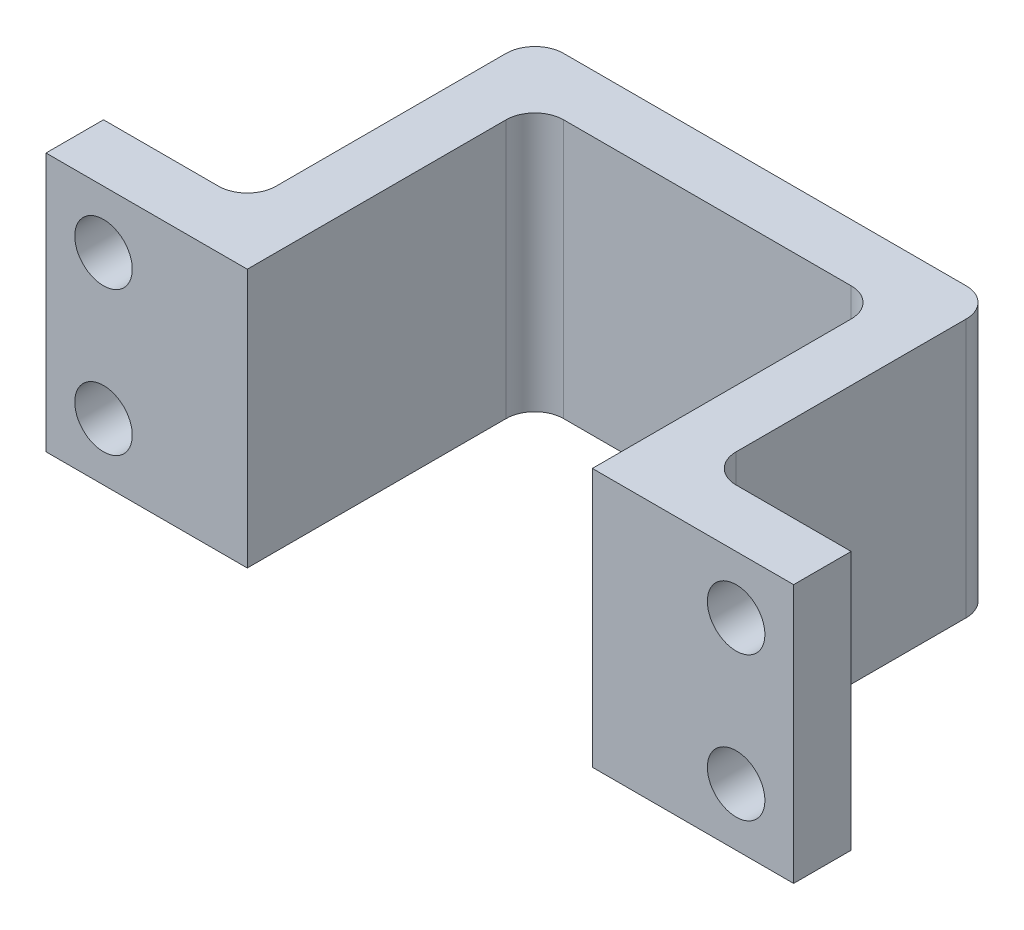
ISO-10303-21;
HEADER;
FILE_DESCRIPTION(('STEP AP214'),'2;1');
FILE_NAME('part.step','',(''),(''),'','','');
FILE_SCHEMA(('AUTOMOTIVE_DESIGN { 1 0 10303 214 1 1 1 1 }'));
ENDSEC;
DATA;
#1=APPLICATION_CONTEXT('core data for automotive mechanical design processes');
#2=APPLICATION_PROTOCOL_DEFINITION('international standard','automotive_design',2000,#1);
#3=PRODUCT_CONTEXT('',#1,'mechanical');
#4=PRODUCT('Part','Part','',(#3));
#5=PRODUCT_RELATED_PRODUCT_CATEGORY('part','',(#4));
#6=PRODUCT_DEFINITION_FORMATION('','',#4);
#7=PRODUCT_DEFINITION_CONTEXT('part definition',#1,'design');
#8=PRODUCT_DEFINITION('design','',#6,#7);
#9=PRODUCT_DEFINITION_SHAPE('','',#8);
#10=(LENGTH_UNIT() NAMED_UNIT(*) SI_UNIT(.MILLI.,.METRE.));
#11=(NAMED_UNIT(*) PLANE_ANGLE_UNIT() SI_UNIT($,.RADIAN.));
#12=(NAMED_UNIT(*) SI_UNIT($,.STERADIAN.) SOLID_ANGLE_UNIT());
#13=UNCERTAINTY_MEASURE_WITH_UNIT(LENGTH_MEASURE(1.E-05),#10,'distance_accuracy_value','');
#14=(GEOMETRIC_REPRESENTATION_CONTEXT(3) GLOBAL_UNCERTAINTY_ASSIGNED_CONTEXT((#13)) GLOBAL_UNIT_ASSIGNED_CONTEXT((#10,
#11,#12)) REPRESENTATION_CONTEXT('',''));
#15=CARTESIAN_POINT('',(0.,0.,0.));
#16=DIRECTION('',(0.,0.,1.));
#17=DIRECTION('',(1.,0.,0.));
#18=AXIS2_PLACEMENT_3D('',#15,#16,#17);
#19=CARTESIAN_POINT('',(0.,9.,0.));
#20=DIRECTION('',(-1.,0.,0.));
#21=DIRECTION('',(0.,0.,1.));
#22=AXIS2_PLACEMENT_3D('',#19,#20,#21);
#23=PLANE('',#22);
#24=DIRECTION('',(0.,0.,-1.));
#25=VECTOR('',#24,1.);
#26=CARTESIAN_POINT('',(0.,0.,0.));
#27=LINE('',#26,#25);
#28=CARTESIAN_POINT('',(0.,0.,0.));
#29=VERTEX_POINT('',#28);
#30=CARTESIAN_POINT('',(0.,0.,-8.99999999999999));
#31=VERTEX_POINT('',#30);
#32=EDGE_CURVE('E205',#29,#31,#27,.T.);
#33=ORIENTED_EDGE('',*,*,#32,.T.);
#34=DIRECTION('',(0.,-1.,0.));
#35=VECTOR('',#34,1.);
#36=CARTESIAN_POINT('',(0.,9.,-8.99999999999999));
#37=LINE('',#36,#35);
#38=CARTESIAN_POINT('',(0.,9.,-8.99999999999999));
#39=VERTEX_POINT('',#38);
#40=EDGE_CURVE('E48',#39,#31,#37,.T.);
#41=ORIENTED_EDGE('',*,*,#40,.F.);
#42=DIRECTION('',(0.,0.,-1.));
#43=VECTOR('',#42,1.);
#44=CARTESIAN_POINT('',(0.,9.,0.));
#45=LINE('',#44,#43);
#46=CARTESIAN_POINT('',(0.,9.,0.));
#47=VERTEX_POINT('',#46);
#48=EDGE_CURVE('E131',#47,#39,#45,.T.);
#49=ORIENTED_EDGE('',*,*,#48,.F.);
#50=DIRECTION('',(0.,-1.,0.));
#51=VECTOR('',#50,1.);
#52=CARTESIAN_POINT('',(0.,9.,0.));
#53=LINE('',#52,#51);
#54=EDGE_CURVE('E11',#47,#29,#53,.T.);
#55=ORIENTED_EDGE('',*,*,#54,.T.);
#56=EDGE_LOOP('',(#33,#41,#49,#55));
#57=FACE_BOUND('',#56,.T.);
#58=ADVANCED_FACE('F38',(#57),#23,.F.);
#59=CARTESIAN_POINT('',(1.,9.,-9.));
#60=DIRECTION('',(0.,-1.,0.));
#61=DIRECTION('',(0.,0.,-1.));
#62=AXIS2_PLACEMENT_3D('',#59,#60,#61);
#63=CYLINDRICAL_SURFACE('',#62,1.);
#64=CARTESIAN_POINT('',(1.,0.,-9.));
#65=DIRECTION('',(0.,-1.,0.));
#66=DIRECTION('',(0.,0.,-1.));
#67=AXIS2_PLACEMENT_3D('',#64,#65,#66);
#68=CIRCLE('',#67,1.);
#69=CARTESIAN_POINT('',(1.,0.,-10.));
#70=VERTEX_POINT('',#69);
#71=EDGE_CURVE('E208',#31,#70,#68,.T.);
#72=ORIENTED_EDGE('',*,*,#71,.T.);
#73=DIRECTION('',(0.,-1.,0.));
#74=VECTOR('',#73,1.);
#75=CARTESIAN_POINT('',(1.,9.,-10.));
#76=LINE('',#75,#74);
#77=CARTESIAN_POINT('',(1.,9.,-10.));
#78=VERTEX_POINT('',#77);
#79=EDGE_CURVE('E308',#78,#70,#76,.T.);
#80=ORIENTED_EDGE('',*,*,#79,.F.);
#81=CARTESIAN_POINT('',(1.,9.,-9.));
#82=DIRECTION('',(0.,-1.,0.));
#83=DIRECTION('',(0.,0.,-1.));
#84=AXIS2_PLACEMENT_3D('',#81,#82,#83);
#85=CIRCLE('',#84,1.);
#86=EDGE_CURVE('E345',#39,#78,#85,.T.);
#87=ORIENTED_EDGE('',*,*,#86,.F.);
#88=ORIENTED_EDGE('',*,*,#40,.T.);
#89=EDGE_LOOP('',(#72,#80,#87,#88));
#90=FACE_BOUND('',#89,.T.);
#91=ADVANCED_FACE('F401',(#90),#63,.F.);
#92=CARTESIAN_POINT('',(1.00000000000001,9.,-10.));
#93=DIRECTION('',(0.,0.,-1.));
#94=DIRECTION('',(-1.,0.,0.));
#95=AXIS2_PLACEMENT_3D('',#92,#93,#94);
#96=PLANE('',#95);
#97=DIRECTION('',(1.,0.,0.));
#98=VECTOR('',#97,1.);
#99=CARTESIAN_POINT('',(1.00000000000001,0.,-10.));
#100=LINE('',#99,#98);
#101=CARTESIAN_POINT('',(11.,0.,-10.));
#102=VERTEX_POINT('',#101);
#103=EDGE_CURVE('E212',#70,#102,#100,.T.);
#104=ORIENTED_EDGE('',*,*,#103,.T.);
#105=DIRECTION('',(0.,-1.,0.));
#106=VECTOR('',#105,1.);
#107=CARTESIAN_POINT('',(11.,9.,-10.));
#108=LINE('',#107,#106);
#109=CARTESIAN_POINT('',(11.,9.,-10.));
#110=VERTEX_POINT('',#109);
#111=EDGE_CURVE('E304',#110,#102,#108,.T.);
#112=ORIENTED_EDGE('',*,*,#111,.F.);
#113=DIRECTION('',(1.,0.,0.));
#114=VECTOR('',#113,1.);
#115=CARTESIAN_POINT('',(1.00000000000001,9.,-10.));
#116=LINE('',#115,#114);
#117=EDGE_CURVE('E348',#78,#110,#116,.T.);
#118=ORIENTED_EDGE('',*,*,#117,.F.);
#119=ORIENTED_EDGE('',*,*,#79,.T.);
#120=EDGE_LOOP('',(#104,#112,#118,#119));
#121=FACE_BOUND('',#120,.T.);
#122=ADVANCED_FACE('F406',(#121),#96,.F.);
#123=CARTESIAN_POINT('',(11.,9.,-9.));
#124=DIRECTION('',(0.,-1.,0.));
#125=DIRECTION('',(0.,0.,-1.));
#126=AXIS2_PLACEMENT_3D('',#123,#124,#125);
#127=CYLINDRICAL_SURFACE('',#126,0.999999999999999);
#128=CARTESIAN_POINT('',(11.,0.,-9.));
#129=DIRECTION('',(0.,-1.,0.));
#130=DIRECTION('',(0.,0.,-1.));
#131=AXIS2_PLACEMENT_3D('',#128,#129,#130);
#132=CIRCLE('',#131,0.999999999999999);
#133=CARTESIAN_POINT('',(12.,0.,-8.99999999999999));
#134=VERTEX_POINT('',#133);
#135=EDGE_CURVE('E215',#102,#134,#132,.T.);
#136=ORIENTED_EDGE('',*,*,#135,.T.);
#137=DIRECTION('',(0.,-1.,0.));
#138=VECTOR('',#137,1.);
#139=CARTESIAN_POINT('',(12.,9.,-8.99999999999999));
#140=LINE('',#139,#138);
#141=CARTESIAN_POINT('',(12.,9.,-8.99999999999999));
#142=VERTEX_POINT('',#141);
#143=EDGE_CURVE('E300',#142,#134,#140,.T.);
#144=ORIENTED_EDGE('',*,*,#143,.F.);
#145=CARTESIAN_POINT('',(11.,9.,-9.));
#146=DIRECTION('',(0.,-1.,0.));
#147=DIRECTION('',(0.,0.,-1.));
#148=AXIS2_PLACEMENT_3D('',#145,#146,#147);
#149=CIRCLE('',#148,0.999999999999999);
#150=EDGE_CURVE('E351',#110,#142,#149,.T.);
#151=ORIENTED_EDGE('',*,*,#150,.F.);
#152=ORIENTED_EDGE('',*,*,#111,.T.);
#153=EDGE_LOOP('',(#136,#144,#151,#152));
#154=FACE_BOUND('',#153,.T.);
#155=ADVANCED_FACE('F412',(#154),#127,.F.);
#156=CARTESIAN_POINT('',(12.,9.,0.));
#157=DIRECTION('',(1.,0.,0.));
#158=DIRECTION('',(0.,0.,-1.));
#159=AXIS2_PLACEMENT_3D('',#156,#157,#158);
#160=PLANE('',#159);
#161=DIRECTION('',(0.,0.,1.));
#162=VECTOR('',#161,1.);
#163=CARTESIAN_POINT('',(12.,0.,0.));
#164=LINE('',#163,#162);
#165=CARTESIAN_POINT('',(12.,0.,0.));
#166=VERTEX_POINT('',#165);
#167=EDGE_CURVE('E218',#134,#166,#164,.T.);
#168=ORIENTED_EDGE('',*,*,#167,.T.);
#169=DIRECTION('',(0.,-1.,0.));
#170=VECTOR('',#169,1.);
#171=CARTESIAN_POINT('',(12.,9.,0.));
#172=LINE('',#171,#170);
#173=CARTESIAN_POINT('',(12.,9.,0.));
#174=VERTEX_POINT('',#173);
#175=EDGE_CURVE('E296',#174,#166,#172,.T.);
#176=ORIENTED_EDGE('',*,*,#175,.F.);
#177=DIRECTION('',(0.,0.,1.));
#178=VECTOR('',#177,1.);
#179=CARTESIAN_POINT('',(12.,9.,0.));
#180=LINE('',#179,#178);
#181=EDGE_CURVE('E354',#142,#174,#180,.T.);
#182=ORIENTED_EDGE('',*,*,#181,.F.);
#183=ORIENTED_EDGE('',*,*,#143,.T.);
#184=EDGE_LOOP('',(#168,#176,#182,#183));
#185=FACE_BOUND('',#184,.T.);
#186=ADVANCED_FACE('F416',(#185),#160,.F.);
#187=CARTESIAN_POINT('',(13.3183856502242,9.,0.));
#188=DIRECTION('',(0.,0.,-1.));
#189=DIRECTION('',(-1.,0.,0.));
#190=AXIS2_PLACEMENT_3D('',#187,#188,#189);
#191=PLANE('',#190);
#192=CARTESIAN_POINT('',(17.,2.,0.));
#193=DIRECTION('',(0.,0.,-1.));
#194=DIRECTION('',(-1.,0.,0.));
#195=AXIS2_PLACEMENT_3D('',#192,#193,#194);
#196=CIRCLE('',#195,1.);
#197=CARTESIAN_POINT('',(16.,2.,0.));
#198=VERTEX_POINT('',#197);
#199=EDGE_CURVE('E209',#198,#198,#196,.T.);
#200=ORIENTED_EDGE('',*,*,#199,.T.);
#201=EDGE_LOOP('',(#200));
#202=FACE_BOUND('',#201,.T.);
#203=CARTESIAN_POINT('',(17.,7.,0.));
#204=DIRECTION('',(0.,0.,-1.));
#205=DIRECTION('',(-1.,0.,0.));
#206=AXIS2_PLACEMENT_3D('',#203,#204,#205);
#207=CIRCLE('',#206,1.);
#208=CARTESIAN_POINT('',(16.,7.,0.));
#209=VERTEX_POINT('',#208);
#210=EDGE_CURVE('E323',#209,#209,#207,.T.);
#211=ORIENTED_EDGE('',*,*,#210,.T.);
#212=EDGE_LOOP('',(#211));
#213=FACE_BOUND('',#212,.T.);
#214=DIRECTION('',(1.,0.,0.));
#215=VECTOR('',#214,1.);
#216=CARTESIAN_POINT('',(13.3183856502242,0.,0.));
#217=LINE('',#216,#215);
#218=CARTESIAN_POINT('',(19.,0.,0.));
#219=VERTEX_POINT('',#218);
#220=EDGE_CURVE('E222',#166,#219,#217,.T.);
#221=ORIENTED_EDGE('',*,*,#220,.T.);
#222=DIRECTION('',(0.,-1.,0.));
#223=VECTOR('',#222,1.);
#224=CARTESIAN_POINT('',(19.,9.,0.));
#225=LINE('',#224,#223);
#226=CARTESIAN_POINT('',(19.,9.,0.));
#227=VERTEX_POINT('',#226);
#228=EDGE_CURVE('E292',#227,#219,#225,.T.);
#229=ORIENTED_EDGE('',*,*,#228,.F.);
#230=DIRECTION('',(1.,0.,0.));
#231=VECTOR('',#230,1.);
#232=CARTESIAN_POINT('',(12.,9.,0.));
#233=LINE('',#232,#231);
#234=EDGE_CURVE('E357',#174,#227,#233,.T.);
#235=ORIENTED_EDGE('',*,*,#234,.F.);
#236=ORIENTED_EDGE('',*,*,#175,.T.);
#237=EDGE_LOOP('',(#221,#229,#235,#236));
#238=FACE_BOUND('',#237,.T.);
#239=ADVANCED_FACE('F420',(#202,#213,#238),#191,.F.);
#240=CARTESIAN_POINT('',(19.,9.,0.));
#241=DIRECTION('',(-1.,0.,0.));
#242=DIRECTION('',(0.,0.,1.));
#243=AXIS2_PLACEMENT_3D('',#240,#241,#242);
#244=PLANE('',#243);
#245=DIRECTION('',(0.,0.,-1.));
#246=VECTOR('',#245,1.);
#247=CARTESIAN_POINT('',(19.,0.,0.));
#248=LINE('',#247,#246);
#249=CARTESIAN_POINT('',(19.,0.,-2.));
#250=VERTEX_POINT('',#249);
#251=EDGE_CURVE('E225',#219,#250,#248,.T.);
#252=ORIENTED_EDGE('',*,*,#251,.T.);
#253=DIRECTION('',(0.,-1.,0.));
#254=VECTOR('',#253,1.);
#255=CARTESIAN_POINT('',(19.,9.,-2.));
#256=LINE('',#255,#254);
#257=CARTESIAN_POINT('',(19.,9.,-2.));
#258=VERTEX_POINT('',#257);
#259=EDGE_CURVE('E288',#258,#250,#256,.T.);
#260=ORIENTED_EDGE('',*,*,#259,.F.);
#261=DIRECTION('',(0.,0.,-1.));
#262=VECTOR('',#261,1.);
#263=CARTESIAN_POINT('',(19.,9.,0.));
#264=LINE('',#263,#262);
#265=EDGE_CURVE('E360',#227,#258,#264,.T.);
#266=ORIENTED_EDGE('',*,*,#265,.F.);
#267=ORIENTED_EDGE('',*,*,#228,.T.);
#268=EDGE_LOOP('',(#252,#260,#266,#267));
#269=FACE_BOUND('',#268,.T.);
#270=ADVANCED_FACE('F426',(#269),#244,.F.);
#271=CARTESIAN_POINT('',(15.,9.,-2.));
#272=DIRECTION('',(0.,0.,1.));
#273=DIRECTION('',(1.,0.,0.));
#274=AXIS2_PLACEMENT_3D('',#271,#272,#273);
#275=PLANE('',#274);
#276=CARTESIAN_POINT('',(17.,2.,-2.));
#277=DIRECTION('',(0.,0.,-1.));
#278=DIRECTION('',(-1.,0.,0.));
#279=AXIS2_PLACEMENT_3D('',#276,#277,#278);
#280=CIRCLE('',#279,1.);
#281=CARTESIAN_POINT('',(16.,2.,-2.));
#282=VERTEX_POINT('',#281);
#283=EDGE_CURVE('E331',#282,#282,#280,.T.);
#284=ORIENTED_EDGE('',*,*,#283,.F.);
#285=EDGE_LOOP('',(#284));
#286=FACE_BOUND('',#285,.T.);
#287=CARTESIAN_POINT('',(17.,7.,-2.));
#288=DIRECTION('',(0.,0.,-1.));
#289=DIRECTION('',(-1.,0.,0.));
#290=AXIS2_PLACEMENT_3D('',#287,#288,#289);
#291=CIRCLE('',#290,1.);
#292=CARTESIAN_POINT('',(16.,7.,-2.));
#293=VERTEX_POINT('',#292);
#294=EDGE_CURVE('E317',#293,#293,#291,.T.);
#295=ORIENTED_EDGE('',*,*,#294,.F.);
#296=EDGE_LOOP('',(#295));
#297=FACE_BOUND('',#296,.T.);
#298=DIRECTION('',(-1.,0.,0.));
#299=VECTOR('',#298,1.);
#300=CARTESIAN_POINT('',(15.,0.,-2.));
#301=LINE('',#300,#299);
#302=CARTESIAN_POINT('',(15.,0.,-2.));
#303=VERTEX_POINT('',#302);
#304=EDGE_CURVE('E228',#250,#303,#301,.T.);
#305=ORIENTED_EDGE('',*,*,#304,.T.);
#306=DIRECTION('',(0.,-1.,0.));
#307=VECTOR('',#306,1.);
#308=CARTESIAN_POINT('',(15.,9.,-2.));
#309=LINE('',#308,#307);
#310=CARTESIAN_POINT('',(15.,9.,-2.));
#311=VERTEX_POINT('',#310);
#312=EDGE_CURVE('E284',#311,#303,#309,.T.);
#313=ORIENTED_EDGE('',*,*,#312,.F.);
#314=DIRECTION('',(-1.,0.,0.));
#315=VECTOR('',#314,1.);
#316=CARTESIAN_POINT('',(15.,9.,-2.));
#317=LINE('',#316,#315);
#318=EDGE_CURVE('E363',#258,#311,#317,.T.);
#319=ORIENTED_EDGE('',*,*,#318,.F.);
#320=ORIENTED_EDGE('',*,*,#259,.T.);
#321=EDGE_LOOP('',(#305,#313,#319,#320));
#322=FACE_BOUND('',#321,.T.);
#323=ADVANCED_FACE('F430',(#286,#297,#322),#275,.F.);
#324=CARTESIAN_POINT('',(15.,9.,-3.));
#325=DIRECTION('',(0.,-1.,0.));
#326=DIRECTION('',(0.,0.,-1.));
#327=AXIS2_PLACEMENT_3D('',#324,#325,#326);
#328=CYLINDRICAL_SURFACE('',#327,1.);
#329=CARTESIAN_POINT('',(15.,0.,-3.));
#330=DIRECTION('',(0.,-1.,0.));
#331=DIRECTION('',(0.,0.,1.));
#332=AXIS2_PLACEMENT_3D('',#329,#330,#331);
#333=CIRCLE('',#332,1.);
#334=CARTESIAN_POINT('',(14.,0.,-3.00000000000001));
#335=VERTEX_POINT('',#334);
#336=EDGE_CURVE('E231',#303,#335,#333,.T.);
#337=ORIENTED_EDGE('',*,*,#336,.T.);
#338=DIRECTION('',(0.,-1.,0.));
#339=VECTOR('',#338,1.);
#340=CARTESIAN_POINT('',(14.,9.,-3.00000000000001));
#341=LINE('',#340,#339);
#342=CARTESIAN_POINT('',(14.,9.,-3.00000000000001));
#343=VERTEX_POINT('',#342);
#344=EDGE_CURVE('E280',#343,#335,#341,.T.);
#345=ORIENTED_EDGE('',*,*,#344,.F.);
#346=CARTESIAN_POINT('',(15.,9.,-3.));
#347=DIRECTION('',(0.,-1.,0.));
#348=DIRECTION('',(0.,0.,1.));
#349=AXIS2_PLACEMENT_3D('',#346,#347,#348);
#350=CIRCLE('',#349,1.);
#351=EDGE_CURVE('E366',#311,#343,#350,.T.);
#352=ORIENTED_EDGE('',*,*,#351,.F.);
#353=ORIENTED_EDGE('',*,*,#312,.T.);
#354=EDGE_LOOP('',(#337,#345,#352,#353));
#355=FACE_BOUND('',#354,.T.);
#356=ADVANCED_FACE('F435',(#355),#328,.F.);
#357=CARTESIAN_POINT('',(14.,9.,-3.00000000000001));
#358=DIRECTION('',(-1.,0.,0.));
#359=DIRECTION('',(0.,0.,1.));
#360=AXIS2_PLACEMENT_3D('',#357,#358,#359);
#361=PLANE('',#360);
#362=DIRECTION('',(0.,0.,-1.));
#363=VECTOR('',#362,1.);
#364=CARTESIAN_POINT('',(14.,0.,-3.00000000000001));
#365=LINE('',#364,#363);
#366=CARTESIAN_POINT('',(14.,0.,-11.));
#367=VERTEX_POINT('',#366);
#368=EDGE_CURVE('E234',#335,#367,#365,.T.);
#369=ORIENTED_EDGE('',*,*,#368,.T.);
#370=DIRECTION('',(0.,-1.,0.));
#371=VECTOR('',#370,1.);
#372=CARTESIAN_POINT('',(14.,9.,-11.));
#373=LINE('',#372,#371);
#374=CARTESIAN_POINT('',(14.,9.,-11.));
#375=VERTEX_POINT('',#374);
#376=EDGE_CURVE('E276',#375,#367,#373,.T.);
#377=ORIENTED_EDGE('',*,*,#376,.F.);
#378=DIRECTION('',(0.,0.,-1.));
#379=VECTOR('',#378,1.);
#380=CARTESIAN_POINT('',(14.,9.,-3.00000000000001));
#381=LINE('',#380,#379);
#382=EDGE_CURVE('E369',#343,#375,#381,.T.);
#383=ORIENTED_EDGE('',*,*,#382,.F.);
#384=ORIENTED_EDGE('',*,*,#344,.T.);
#385=EDGE_LOOP('',(#369,#377,#383,#384));
#386=FACE_BOUND('',#385,.T.);
#387=ADVANCED_FACE('F441',(#386),#361,.F.);
#388=CARTESIAN_POINT('',(13.,9.,-11.));
#389=DIRECTION('',(0.,-1.,0.));
#390=DIRECTION('',(0.,0.,-1.));
#391=AXIS2_PLACEMENT_3D('',#388,#389,#390);
#392=CYLINDRICAL_SURFACE('',#391,0.999999999999999);
#393=CARTESIAN_POINT('',(13.,0.,-11.));
#394=DIRECTION('',(0.,1.,0.));
#395=DIRECTION('',(0.,0.,-1.));
#396=AXIS2_PLACEMENT_3D('',#393,#394,#395);
#397=CIRCLE('',#396,0.999999999999999);
#398=CARTESIAN_POINT('',(13.,0.,-12.));
#399=VERTEX_POINT('',#398);
#400=EDGE_CURVE('E237',#367,#399,#397,.T.);
#401=ORIENTED_EDGE('',*,*,#400,.T.);
#402=DIRECTION('',(0.,-1.,0.));
#403=VECTOR('',#402,1.);
#404=CARTESIAN_POINT('',(13.,9.,-12.));
#405=LINE('',#404,#403);
#406=CARTESIAN_POINT('',(13.,9.,-12.));
#407=VERTEX_POINT('',#406);
#408=EDGE_CURVE('E272',#407,#399,#405,.T.);
#409=ORIENTED_EDGE('',*,*,#408,.F.);
#410=CARTESIAN_POINT('',(13.,9.,-11.));
#411=DIRECTION('',(0.,1.,0.));
#412=DIRECTION('',(0.,0.,-1.));
#413=AXIS2_PLACEMENT_3D('',#410,#411,#412);
#414=CIRCLE('',#413,0.999999999999999);
#415=EDGE_CURVE('E372',#375,#407,#414,.T.);
#416=ORIENTED_EDGE('',*,*,#415,.F.);
#417=ORIENTED_EDGE('',*,*,#376,.T.);
#418=EDGE_LOOP('',(#401,#409,#416,#417));
#419=FACE_BOUND('',#418,.T.);
#420=ADVANCED_FACE('F445',(#419),#392,.T.);
#421=CARTESIAN_POINT('',(-0.999999999999993,9.,-12.));
#422=DIRECTION('',(0.,0.,1.));
#423=DIRECTION('',(1.,0.,0.));
#424=AXIS2_PLACEMENT_3D('',#421,#422,#423);
#425=PLANE('',#424);
#426=DIRECTION('',(-1.,0.,0.));
#427=VECTOR('',#426,1.);
#428=CARTESIAN_POINT('',(-0.999999999999993,0.,-12.));
#429=LINE('',#428,#427);
#430=CARTESIAN_POINT('',(-0.999999999999993,0.,-12.));
#431=VERTEX_POINT('',#430);
#432=EDGE_CURVE('E240',#399,#431,#429,.T.);
#433=ORIENTED_EDGE('',*,*,#432,.T.);
#434=DIRECTION('',(0.,-1.,0.));
#435=VECTOR('',#434,1.);
#436=CARTESIAN_POINT('',(-0.999999999999993,9.,-12.));
#437=LINE('',#436,#435);
#438=CARTESIAN_POINT('',(-0.999999999999993,9.,-12.));
#439=VERTEX_POINT('',#438);
#440=EDGE_CURVE('E268',#439,#431,#437,.T.);
#441=ORIENTED_EDGE('',*,*,#440,.F.);
#442=DIRECTION('',(-1.,0.,0.));
#443=VECTOR('',#442,1.);
#444=CARTESIAN_POINT('',(-0.999999999999993,9.,-12.));
#445=LINE('',#444,#443);
#446=EDGE_CURVE('E375',#407,#439,#445,.T.);
#447=ORIENTED_EDGE('',*,*,#446,.F.);
#448=ORIENTED_EDGE('',*,*,#408,.T.);
#449=EDGE_LOOP('',(#433,#441,#447,#448));
#450=FACE_BOUND('',#449,.T.);
#451=ADVANCED_FACE('F448',(#450),#425,.F.);
#452=CARTESIAN_POINT('',(-1.,9.,-11.));
#453=DIRECTION('',(0.,-1.,0.));
#454=DIRECTION('',(0.,0.,-1.));
#455=AXIS2_PLACEMENT_3D('',#452,#453,#454);
#456=CYLINDRICAL_SURFACE('',#455,1.);
#457=CARTESIAN_POINT('',(-1.,0.,-11.));
#458=DIRECTION('',(0.,1.,0.));
#459=DIRECTION('',(0.,0.,-1.));
#460=AXIS2_PLACEMENT_3D('',#457,#458,#459);
#461=CIRCLE('',#460,1.);
#462=CARTESIAN_POINT('',(-2.,0.,-11.));
#463=VERTEX_POINT('',#462);
#464=EDGE_CURVE('E243',#431,#463,#461,.T.);
#465=ORIENTED_EDGE('',*,*,#464,.T.);
#466=DIRECTION('',(0.,-1.,0.));
#467=VECTOR('',#466,1.);
#468=CARTESIAN_POINT('',(-2.,9.,-11.));
#469=LINE('',#468,#467);
#470=CARTESIAN_POINT('',(-2.,9.,-11.));
#471=VERTEX_POINT('',#470);
#472=EDGE_CURVE('E264',#471,#463,#469,.T.);
#473=ORIENTED_EDGE('',*,*,#472,.F.);
#474=CARTESIAN_POINT('',(-1.,9.,-11.));
#475=DIRECTION('',(0.,1.,0.));
#476=DIRECTION('',(0.,0.,-1.));
#477=AXIS2_PLACEMENT_3D('',#474,#475,#476);
#478=CIRCLE('',#477,1.);
#479=EDGE_CURVE('E378',#439,#471,#478,.T.);
#480=ORIENTED_EDGE('',*,*,#479,.F.);
#481=ORIENTED_EDGE('',*,*,#440,.T.);
#482=EDGE_LOOP('',(#465,#473,#480,#481));
#483=FACE_BOUND('',#482,.T.);
#484=ADVANCED_FACE('F386',(#483),#456,.T.);
#485=CARTESIAN_POINT('',(-2.,9.,-3.00000000000001));
#486=DIRECTION('',(1.,0.,0.));
#487=DIRECTION('',(0.,0.,-1.));
#488=AXIS2_PLACEMENT_3D('',#485,#486,#487);
#489=PLANE('',#488);
#490=DIRECTION('',(0.,0.,1.));
#491=VECTOR('',#490,1.);
#492=CARTESIAN_POINT('',(-2.,0.,-3.00000000000001));
#493=LINE('',#492,#491);
#494=CARTESIAN_POINT('',(-2.,0.,-3.00000000000001));
#495=VERTEX_POINT('',#494);
#496=EDGE_CURVE('E246',#463,#495,#493,.T.);
#497=ORIENTED_EDGE('',*,*,#496,.T.);
#498=DIRECTION('',(0.,-1.,0.));
#499=VECTOR('',#498,1.);
#500=CARTESIAN_POINT('',(-2.,9.,-3.00000000000001));
#501=LINE('',#500,#499);
#502=CARTESIAN_POINT('',(-2.,9.,-3.00000000000001));
#503=VERTEX_POINT('',#502);
#504=EDGE_CURVE('E192',#503,#495,#501,.T.);
#505=ORIENTED_EDGE('',*,*,#504,.F.);
#506=DIRECTION('',(0.,0.,1.));
#507=VECTOR('',#506,1.);
#508=CARTESIAN_POINT('',(-2.,9.,-3.00000000000001));
#509=LINE('',#508,#507);
#510=EDGE_CURVE('E181',#471,#503,#509,.T.);
#511=ORIENTED_EDGE('',*,*,#510,.F.);
#512=ORIENTED_EDGE('',*,*,#472,.T.);
#513=EDGE_LOOP('',(#497,#505,#511,#512));
#514=FACE_BOUND('',#513,.T.);
#515=ADVANCED_FACE('F390',(#514),#489,.F.);
#516=CARTESIAN_POINT('',(-3.,9.,-3.));
#517=DIRECTION('',(0.,-1.,0.));
#518=DIRECTION('',(0.,0.,-1.));
#519=AXIS2_PLACEMENT_3D('',#516,#517,#518);
#520=CYLINDRICAL_SURFACE('',#519,1.);
#521=CARTESIAN_POINT('',(-3.,0.,-3.));
#522=DIRECTION('',(0.,-1.,0.));
#523=DIRECTION('',(0.,0.,-1.));
#524=AXIS2_PLACEMENT_3D('',#521,#522,#523);
#525=CIRCLE('',#524,1.);
#526=CARTESIAN_POINT('',(-3.00000000000001,0.,-2.));
#527=VERTEX_POINT('',#526);
#528=EDGE_CURVE('E190',#495,#527,#525,.T.);
#529=ORIENTED_EDGE('',*,*,#528,.T.);
#530=DIRECTION('',(0.,-1.,0.));
#531=VECTOR('',#530,1.);
#532=CARTESIAN_POINT('',(-3.00000000000001,9.,-2.));
#533=LINE('',#532,#531);
#534=CARTESIAN_POINT('',(-3.00000000000001,9.,-2.));
#535=VERTEX_POINT('',#534);
#536=EDGE_CURVE('E187',#535,#527,#533,.T.);
#537=ORIENTED_EDGE('',*,*,#536,.F.);
#538=CARTESIAN_POINT('',(-3.,9.,-3.));
#539=DIRECTION('',(0.,-1.,0.));
#540=DIRECTION('',(0.,0.,-1.));
#541=AXIS2_PLACEMENT_3D('',#538,#539,#540);
#542=CIRCLE('',#541,1.);
#543=EDGE_CURVE('E175',#503,#535,#542,.T.);
#544=ORIENTED_EDGE('',*,*,#543,.F.);
#545=ORIENTED_EDGE('',*,*,#504,.T.);
#546=EDGE_LOOP('',(#529,#537,#544,#545));
#547=FACE_BOUND('',#546,.T.);
#548=ADVANCED_FACE('F188',(#547),#520,.F.);
#549=CARTESIAN_POINT('',(-3.00000000000001,9.,-2.));
#550=DIRECTION('',(0.,0.,1.));
#551=DIRECTION('',(1.,0.,0.));
#552=AXIS2_PLACEMENT_3D('',#549,#550,#551);
#553=PLANE('',#552);
#554=CARTESIAN_POINT('',(-5.,7.,-2.));
#555=DIRECTION('',(0.,0.,-1.));
#556=DIRECTION('',(-1.,0.,0.));
#557=AXIS2_PLACEMENT_3D('',#554,#555,#556);
#558=CIRCLE('',#557,1.);
#559=CARTESIAN_POINT('',(-6.,7.,-2.));
#560=VERTEX_POINT('',#559);
#561=EDGE_CURVE('E325',#560,#560,#558,.T.);
#562=ORIENTED_EDGE('',*,*,#561,.F.);
#563=EDGE_LOOP('',(#562));
#564=FACE_BOUND('',#563,.T.);
#565=CARTESIAN_POINT('',(-5.,2.,-2.));
#566=DIRECTION('',(0.,0.,-1.));
#567=DIRECTION('',(-1.,0.,0.));
#568=AXIS2_PLACEMENT_3D('',#565,#566,#567);
#569=CIRCLE('',#568,1.);
#570=CARTESIAN_POINT('',(-6.,2.,-2.));
#571=VERTEX_POINT('',#570);
#572=EDGE_CURVE('E613',#571,#571,#569,.T.);
#573=ORIENTED_EDGE('',*,*,#572,.F.);
#574=EDGE_LOOP('',(#573));
#575=FACE_BOUND('',#574,.T.);
#576=DIRECTION('',(-1.,0.,0.));
#577=VECTOR('',#576,1.);
#578=CARTESIAN_POINT('',(-3.00000000000001,0.,-2.));
#579=LINE('',#578,#577);
#580=CARTESIAN_POINT('',(-7.,0.,-2.));
#581=VERTEX_POINT('',#580);
#582=EDGE_CURVE('E117',#527,#581,#579,.T.);
#583=ORIENTED_EDGE('',*,*,#582,.T.);
#584=DIRECTION('',(0.,-1.,0.));
#585=VECTOR('',#584,1.);
#586=CARTESIAN_POINT('',(-7.,9.,-2.));
#587=LINE('',#586,#585);
#588=CARTESIAN_POINT('',(-7.,9.,-2.));
#589=VERTEX_POINT('',#588);
#590=EDGE_CURVE('E193',#589,#581,#587,.T.);
#591=ORIENTED_EDGE('',*,*,#590,.F.);
#592=DIRECTION('',(-1.,0.,0.));
#593=VECTOR('',#592,1.);
#594=CARTESIAN_POINT('',(-3.00000000000001,9.,-2.));
#595=LINE('',#594,#593);
#596=EDGE_CURVE('E179',#535,#589,#595,.T.);
#597=ORIENTED_EDGE('',*,*,#596,.F.);
#598=ORIENTED_EDGE('',*,*,#536,.T.);
#599=EDGE_LOOP('',(#583,#591,#597,#598));
#600=FACE_BOUND('',#599,.T.);
#601=ADVANCED_FACE('F195',(#564,#575,#600),#553,.F.);
#602=CARTESIAN_POINT('',(-7.,9.,0.));
#603=DIRECTION('',(1.,0.,0.));
#604=DIRECTION('',(0.,0.,-1.));
#605=AXIS2_PLACEMENT_3D('',#602,#603,#604);
#606=PLANE('',#605);
#607=DIRECTION('',(0.,0.,1.));
#608=VECTOR('',#607,1.);
#609=CARTESIAN_POINT('',(-7.,0.,0.));
#610=LINE('',#609,#608);
#611=CARTESIAN_POINT('',(-7.,0.,0.));
#612=VERTEX_POINT('',#611);
#613=EDGE_CURVE('E124',#581,#612,#610,.T.);
#614=ORIENTED_EDGE('',*,*,#613,.T.);
#615=DIRECTION('',(0.,-1.,0.));
#616=VECTOR('',#615,1.);
#617=CARTESIAN_POINT('',(-7.,9.,0.));
#618=LINE('',#617,#616);
#619=CARTESIAN_POINT('',(-7.,9.,0.));
#620=VERTEX_POINT('',#619);
#621=EDGE_CURVE('E201',#620,#612,#618,.T.);
#622=ORIENTED_EDGE('',*,*,#621,.F.);
#623=DIRECTION('',(0.,0.,1.));
#624=VECTOR('',#623,1.);
#625=CARTESIAN_POINT('',(-7.,9.,0.));
#626=LINE('',#625,#624);
#627=EDGE_CURVE('E198',#589,#620,#626,.T.);
#628=ORIENTED_EDGE('',*,*,#627,.F.);
#629=ORIENTED_EDGE('',*,*,#590,.T.);
#630=EDGE_LOOP('',(#614,#622,#628,#629));
#631=FACE_BOUND('',#630,.T.);
#632=ADVANCED_FACE('F397',(#631),#606,.F.);
#633=CARTESIAN_POINT('',(-0.237668161434974,9.,0.));
#634=DIRECTION('',(0.,0.,-1.));
#635=DIRECTION('',(-1.,0.,0.));
#636=AXIS2_PLACEMENT_3D('',#633,#634,#635);
#637=PLANE('',#636);
#638=CARTESIAN_POINT('',(-5.,7.,0.));
#639=DIRECTION('',(0.,0.,-1.));
#640=DIRECTION('',(-1.,0.,0.));
#641=AXIS2_PLACEMENT_3D('',#638,#639,#640);
#642=CIRCLE('',#641,1.);
#643=CARTESIAN_POINT('',(-6.,7.,0.));
#644=VERTEX_POINT('',#643);
#645=EDGE_CURVE('E41',#644,#644,#642,.T.);
#646=ORIENTED_EDGE('',*,*,#645,.T.);
#647=EDGE_LOOP('',(#646));
#648=FACE_BOUND('',#647,.T.);
#649=CARTESIAN_POINT('',(-5.,2.,0.));
#650=DIRECTION('',(0.,0.,-1.));
#651=DIRECTION('',(-1.,0.,0.));
#652=AXIS2_PLACEMENT_3D('',#649,#650,#651);
#653=CIRCLE('',#652,1.);
#654=CARTESIAN_POINT('',(-6.,2.,0.));
#655=VERTEX_POINT('',#654);
#656=EDGE_CURVE('E314',#655,#655,#653,.T.);
#657=ORIENTED_EDGE('',*,*,#656,.T.);
#658=EDGE_LOOP('',(#657));
#659=FACE_BOUND('',#658,.T.);
#660=DIRECTION('',(1.,0.,0.));
#661=VECTOR('',#660,1.);
#662=CARTESIAN_POINT('',(-0.237668161434974,0.,0.));
#663=LINE('',#662,#661);
#664=EDGE_CURVE('E255',#612,#29,#663,.T.);
#665=ORIENTED_EDGE('',*,*,#664,.T.);
#666=ORIENTED_EDGE('',*,*,#54,.F.);
#667=DIRECTION('',(1.,0.,0.));
#668=VECTOR('',#667,1.);
#669=CARTESIAN_POINT('',(-0.237668161434974,9.,0.));
#670=LINE('',#669,#668);
#671=EDGE_CURVE('E57',#620,#47,#670,.T.);
#672=ORIENTED_EDGE('',*,*,#671,.F.);
#673=ORIENTED_EDGE('',*,*,#621,.T.);
#674=EDGE_LOOP('',(#665,#666,#672,#673));
#675=FACE_BOUND('',#674,.T.);
#676=ADVANCED_FACE('F396',(#648,#659,#675),#637,.F.);
#677=CARTESIAN_POINT('',(1.,9.,-9.));
#678=DIRECTION('',(0.,-1.,0.));
#679=DIRECTION('',(0.,0.,-1.));
#680=AXIS2_PLACEMENT_3D('',#677,#678,#679);
#681=PLANE('',#680);
#682=ORIENTED_EDGE('',*,*,#671,.T.);
#683=ORIENTED_EDGE('',*,*,#48,.T.);
#684=ORIENTED_EDGE('',*,*,#86,.T.);
#685=ORIENTED_EDGE('',*,*,#117,.T.);
#686=ORIENTED_EDGE('',*,*,#150,.T.);
#687=ORIENTED_EDGE('',*,*,#181,.T.);
#688=ORIENTED_EDGE('',*,*,#234,.T.);
#689=ORIENTED_EDGE('',*,*,#265,.T.);
#690=ORIENTED_EDGE('',*,*,#318,.T.);
#691=ORIENTED_EDGE('',*,*,#351,.T.);
#692=ORIENTED_EDGE('',*,*,#382,.T.);
#693=ORIENTED_EDGE('',*,*,#415,.T.);
#694=ORIENTED_EDGE('',*,*,#446,.T.);
#695=ORIENTED_EDGE('',*,*,#479,.T.);
#696=ORIENTED_EDGE('',*,*,#510,.T.);
#697=ORIENTED_EDGE('',*,*,#543,.T.);
#698=ORIENTED_EDGE('',*,*,#596,.T.);
#699=ORIENTED_EDGE('',*,*,#627,.T.);
#700=EDGE_LOOP('',(#682,#683,#684,#685,#686,#687,#688,#689,#690,#691,#692,#693,#694,#695,#696,
#697,#698,#699));
#701=FACE_BOUND('',#700,.T.);
#702=ADVANCED_FACE('F177',(#701),#681,.F.);
#703=CARTESIAN_POINT('',(1.,0.,-9.));
#704=DIRECTION('',(0.,-1.,0.));
#705=DIRECTION('',(0.,0.,-1.));
#706=AXIS2_PLACEMENT_3D('',#703,#704,#705);
#707=PLANE('',#706);
#708=ORIENTED_EDGE('',*,*,#32,.F.);
#709=ORIENTED_EDGE('',*,*,#664,.F.);
#710=ORIENTED_EDGE('',*,*,#613,.F.);
#711=ORIENTED_EDGE('',*,*,#582,.F.);
#712=ORIENTED_EDGE('',*,*,#528,.F.);
#713=ORIENTED_EDGE('',*,*,#496,.F.);
#714=ORIENTED_EDGE('',*,*,#464,.F.);
#715=ORIENTED_EDGE('',*,*,#432,.F.);
#716=ORIENTED_EDGE('',*,*,#400,.F.);
#717=ORIENTED_EDGE('',*,*,#368,.F.);
#718=ORIENTED_EDGE('',*,*,#336,.F.);
#719=ORIENTED_EDGE('',*,*,#304,.F.);
#720=ORIENTED_EDGE('',*,*,#251,.F.);
#721=ORIENTED_EDGE('',*,*,#220,.F.);
#722=ORIENTED_EDGE('',*,*,#167,.F.);
#723=ORIENTED_EDGE('',*,*,#135,.F.);
#724=ORIENTED_EDGE('',*,*,#103,.F.);
#725=ORIENTED_EDGE('',*,*,#71,.F.);
#726=EDGE_LOOP('',(#708,#709,#710,#711,#712,#713,#714,#715,#716,#717,#718,#719,#720,#721,#722,
#723,#724,#725));
#727=FACE_BOUND('',#726,.T.);
#728=ADVANCED_FACE('F393',(#727),#707,.T.);
#729=CARTESIAN_POINT('',(-5.,2.,7.));
#730=DIRECTION('',(0.,0.,-1.));
#731=DIRECTION('',(-1.,0.,0.));
#732=AXIS2_PLACEMENT_3D('',#729,#730,#731);
#733=CYLINDRICAL_SURFACE('',#732,1.);
#734=ORIENTED_EDGE('',*,*,#572,.T.);
#735=EDGE_LOOP('',(#734));
#736=FACE_BOUND('',#735,.T.);
#737=ORIENTED_EDGE('',*,*,#656,.F.);
#738=EDGE_LOOP('',(#737));
#739=FACE_BOUND('',#738,.T.);
#740=ADVANCED_FACE('F545',(#736,#739),#733,.F.);
#741=CARTESIAN_POINT('',(-5.,7.,7.));
#742=DIRECTION('',(0.,0.,-1.));
#743=DIRECTION('',(-1.,0.,0.));
#744=AXIS2_PLACEMENT_3D('',#741,#742,#743);
#745=CYLINDRICAL_SURFACE('',#744,1.);
#746=ORIENTED_EDGE('',*,*,#561,.T.);
#747=EDGE_LOOP('',(#746));
#748=FACE_BOUND('',#747,.T.);
#749=ORIENTED_EDGE('',*,*,#645,.F.);
#750=EDGE_LOOP('',(#749));
#751=FACE_BOUND('',#750,.T.);
#752=ADVANCED_FACE('F572',(#748,#751),#745,.F.);
#753=CARTESIAN_POINT('',(17.,7.,7.));
#754=DIRECTION('',(0.,0.,-1.));
#755=DIRECTION('',(-1.,0.,0.));
#756=AXIS2_PLACEMENT_3D('',#753,#754,#755);
#757=CYLINDRICAL_SURFACE('',#756,1.);
#758=ORIENTED_EDGE('',*,*,#294,.T.);
#759=EDGE_LOOP('',(#758));
#760=FACE_BOUND('',#759,.T.);
#761=ORIENTED_EDGE('',*,*,#210,.F.);
#762=EDGE_LOOP('',(#761));
#763=FACE_BOUND('',#762,.T.);
#764=ADVANCED_FACE('F582',(#760,#763),#757,.F.);
#765=CARTESIAN_POINT('',(17.,2.,7.));
#766=DIRECTION('',(0.,0.,-1.));
#767=DIRECTION('',(-1.,0.,0.));
#768=AXIS2_PLACEMENT_3D('',#765,#766,#767);
#769=CYLINDRICAL_SURFACE('',#768,1.);
#770=ORIENTED_EDGE('',*,*,#283,.T.);
#771=EDGE_LOOP('',(#770));
#772=FACE_BOUND('',#771,.T.);
#773=ORIENTED_EDGE('',*,*,#199,.F.);
#774=EDGE_LOOP('',(#773));
#775=FACE_BOUND('',#774,.T.);
#776=ADVANCED_FACE('F592',(#772,#775),#769,.F.);
#777=CLOSED_SHELL('',(#58,#91,#122,#155,#186,#239,#270,#323,#356,#387,#420,#451,#484,#515,#548,
#601,#632,#676,#702,#728,#740,#752,#764,#776));
#778=MANIFOLD_SOLID_BREP('B2',#777);
#779=ADVANCED_BREP_SHAPE_REPRESENTATION('',(#18,#778),#14);
#780=SHAPE_DEFINITION_REPRESENTATION(#9,#779);
ENDSEC;
END-ISO-10303-21;
